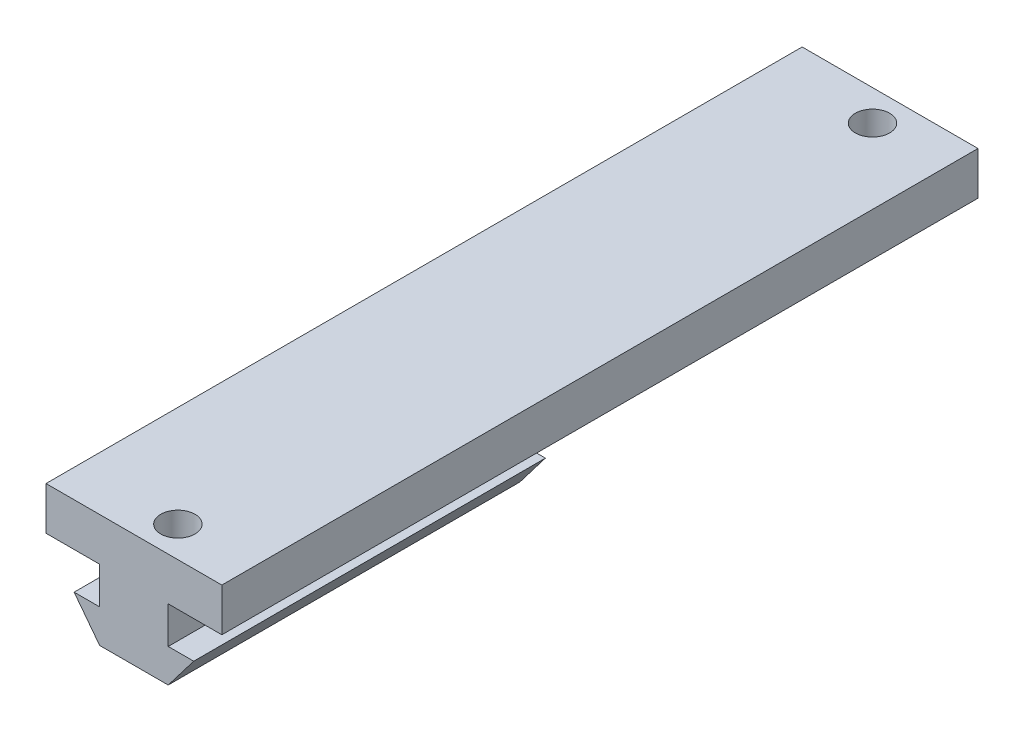
ISO-10303-21;
HEADER;
FILE_DESCRIPTION(('STEP AP214'),'2;1');
FILE_NAME('part.step','',(''),(''),'','','');
FILE_SCHEMA(('AUTOMOTIVE_DESIGN { 1 0 10303 214 1 1 1 1 }'));
ENDSEC;
DATA;
#1=APPLICATION_CONTEXT('core data for automotive mechanical design processes');
#2=APPLICATION_PROTOCOL_DEFINITION('international standard','automotive_design',2000,#1);
#3=PRODUCT_CONTEXT('',#1,'mechanical');
#4=PRODUCT('Part','Part','',(#3));
#5=PRODUCT_RELATED_PRODUCT_CATEGORY('part','',(#4));
#6=PRODUCT_DEFINITION_FORMATION('','',#4);
#7=PRODUCT_DEFINITION_CONTEXT('part definition',#1,'design');
#8=PRODUCT_DEFINITION('design','',#6,#7);
#9=PRODUCT_DEFINITION_SHAPE('','',#8);
#10=(LENGTH_UNIT() NAMED_UNIT(*) SI_UNIT(.MILLI.,.METRE.));
#11=(NAMED_UNIT(*) PLANE_ANGLE_UNIT() SI_UNIT($,.RADIAN.));
#12=(NAMED_UNIT(*) SI_UNIT($,.STERADIAN.) SOLID_ANGLE_UNIT());
#13=UNCERTAINTY_MEASURE_WITH_UNIT(LENGTH_MEASURE(1.E-05),#10,'distance_accuracy_value','');
#14=(GEOMETRIC_REPRESENTATION_CONTEXT(3) GLOBAL_UNCERTAINTY_ASSIGNED_CONTEXT((#13)) GLOBAL_UNIT_ASSIGNED_CONTEXT((#10,
#11,#12)) REPRESENTATION_CONTEXT('',''));
#15=CARTESIAN_POINT('',(0.,0.,0.));
#16=DIRECTION('',(0.,0.,1.));
#17=DIRECTION('',(1.,0.,0.));
#18=AXIS2_PLACEMENT_3D('',#15,#16,#17);
#19=CARTESIAN_POINT('',(10.,4.9,43.));
#20=DIRECTION('',(-1.,0.,0.));
#21=DIRECTION('',(0.,0.,1.));
#22=AXIS2_PLACEMENT_3D('',#19,#20,#21);
#23=PLANE('',#22);
#24=DIRECTION('',(0.,0.,-1.));
#25=VECTOR('',#24,1.);
#26=CARTESIAN_POINT('',(10.,0.,43.));
#27=LINE('',#26,#25);
#28=CARTESIAN_POINT('',(10.,0.,43.));
#29=VERTEX_POINT('',#28);
#30=CARTESIAN_POINT('',(10.,0.,-43.));
#31=VERTEX_POINT('',#30);
#32=EDGE_CURVE('E220',#29,#31,#27,.T.);
#33=ORIENTED_EDGE('',*,*,#32,.T.);
#34=DIRECTION('',(0.,-1.,0.));
#35=VECTOR('',#34,1.);
#36=CARTESIAN_POINT('',(10.,4.9,-43.));
#37=LINE('',#36,#35);
#38=CARTESIAN_POINT('',(10.,4.9,-43.));
#39=VERTEX_POINT('',#38);
#40=EDGE_CURVE('E11',#39,#31,#37,.T.);
#41=ORIENTED_EDGE('',*,*,#40,.F.);
#42=DIRECTION('',(0.,0.,-1.));
#43=VECTOR('',#42,1.);
#44=CARTESIAN_POINT('',(10.,4.9,43.));
#45=LINE('',#44,#43);
#46=CARTESIAN_POINT('',(10.,4.9,43.));
#47=VERTEX_POINT('',#46);
#48=EDGE_CURVE('E238',#47,#39,#45,.T.);
#49=ORIENTED_EDGE('',*,*,#48,.F.);
#50=DIRECTION('',(0.,-1.,0.));
#51=VECTOR('',#50,1.);
#52=CARTESIAN_POINT('',(10.,4.9,43.));
#53=LINE('',#52,#51);
#54=EDGE_CURVE('E249',#47,#29,#53,.T.);
#55=ORIENTED_EDGE('',*,*,#54,.T.);
#56=EDGE_LOOP('',(#33,#41,#49,#55));
#57=FACE_BOUND('',#56,.T.);
#58=ADVANCED_FACE('F44',(#57),#23,.F.);
#59=CARTESIAN_POINT('',(-10.,4.9,-43.));
#60=DIRECTION('',(0.,0.,1.));
#61=DIRECTION('',(1.,0.,0.));
#62=AXIS2_PLACEMENT_3D('',#59,#60,#61);
#63=PLANE('',#62);
#64=DIRECTION('',(-1.,0.,0.));
#65=VECTOR('',#64,1.);
#66=CARTESIAN_POINT('',(-10.,0.,-43.));
#67=LINE('',#66,#65);
#68=CARTESIAN_POINT('',(-10.,0.,-43.));
#69=VERTEX_POINT('',#68);
#70=EDGE_CURVE('E253',#31,#69,#67,.T.);
#71=ORIENTED_EDGE('',*,*,#70,.T.);
#72=DIRECTION('',(0.,-1.,0.));
#73=VECTOR('',#72,1.);
#74=CARTESIAN_POINT('',(-10.,4.9,-43.));
#75=LINE('',#74,#73);
#76=CARTESIAN_POINT('',(-10.,4.9,-43.));
#77=VERTEX_POINT('',#76);
#78=EDGE_CURVE('E53',#77,#69,#75,.T.);
#79=ORIENTED_EDGE('',*,*,#78,.F.);
#80=DIRECTION('',(-1.,0.,0.));
#81=VECTOR('',#80,1.);
#82=CARTESIAN_POINT('',(-10.,4.9,-43.));
#83=LINE('',#82,#81);
#84=EDGE_CURVE('E97',#39,#77,#83,.T.);
#85=ORIENTED_EDGE('',*,*,#84,.F.);
#86=ORIENTED_EDGE('',*,*,#40,.T.);
#87=EDGE_LOOP('',(#71,#79,#85,#86));
#88=FACE_BOUND('',#87,.T.);
#89=ADVANCED_FACE('F295',(#88),#63,.F.);
#90=CARTESIAN_POINT('',(-10.,4.9,43.));
#91=DIRECTION('',(1.,0.,0.));
#92=DIRECTION('',(0.,0.,-1.));
#93=AXIS2_PLACEMENT_3D('',#90,#91,#92);
#94=PLANE('',#93);
#95=DIRECTION('',(0.,0.,1.));
#96=VECTOR('',#95,1.);
#97=CARTESIAN_POINT('',(-10.,0.,43.));
#98=LINE('',#97,#96);
#99=CARTESIAN_POINT('',(-10.,0.,43.));
#100=VERTEX_POINT('',#99);
#101=EDGE_CURVE('E256',#69,#100,#98,.T.);
#102=ORIENTED_EDGE('',*,*,#101,.T.);
#103=DIRECTION('',(0.,-1.,0.));
#104=VECTOR('',#103,1.);
#105=CARTESIAN_POINT('',(-10.,4.9,43.));
#106=LINE('',#105,#104);
#107=CARTESIAN_POINT('',(-10.,4.9,43.));
#108=VERTEX_POINT('',#107);
#109=EDGE_CURVE('E263',#108,#100,#106,.T.);
#110=ORIENTED_EDGE('',*,*,#109,.F.);
#111=DIRECTION('',(0.,0.,1.));
#112=VECTOR('',#111,1.);
#113=CARTESIAN_POINT('',(-10.,4.9,43.));
#114=LINE('',#113,#112);
#115=EDGE_CURVE('E244',#77,#108,#114,.T.);
#116=ORIENTED_EDGE('',*,*,#115,.F.);
#117=ORIENTED_EDGE('',*,*,#78,.T.);
#118=EDGE_LOOP('',(#102,#110,#116,#117));
#119=FACE_BOUND('',#118,.T.);
#120=ADVANCED_FACE('F272',(#119),#94,.F.);
#121=CARTESIAN_POINT('',(-10.,4.9,43.));
#122=DIRECTION('',(0.,0.,-1.));
#123=DIRECTION('',(-1.,0.,0.));
#124=AXIS2_PLACEMENT_3D('',#121,#122,#123);
#125=PLANE('',#124);
#126=DIRECTION('',(1.,0.,0.));
#127=VECTOR('',#126,1.);
#128=CARTESIAN_POINT('',(-10.,0.,43.));
#129=LINE('',#128,#127);
#130=CARTESIAN_POINT('',(-3.90000000000001,0.,43.));
#131=VERTEX_POINT('',#130);
#132=EDGE_CURVE('E241',#100,#131,#129,.T.);
#133=ORIENTED_EDGE('',*,*,#132,.T.);
#134=DIRECTION('',(0.,-1.,0.));
#135=VECTOR('',#134,1.);
#136=CARTESIAN_POINT('',(-3.90000000000001,0.,43.));
#137=LINE('',#136,#135);
#138=CARTESIAN_POINT('',(-3.90000000000001,-4.2,43.));
#139=VERTEX_POINT('',#138);
#140=EDGE_CURVE('E60',#131,#139,#137,.T.);
#141=ORIENTED_EDGE('',*,*,#140,.T.);
#142=DIRECTION('',(-1.,0.,0.));
#143=VECTOR('',#142,1.);
#144=CARTESIAN_POINT('',(-3.90000000000001,-4.2,43.));
#145=LINE('',#144,#143);
#146=CARTESIAN_POINT('',(-6.80000000000001,-4.2,43.));
#147=VERTEX_POINT('',#146);
#148=EDGE_CURVE('E199',#139,#147,#145,.T.);
#149=ORIENTED_EDGE('',*,*,#148,.T.);
#150=DIRECTION('',(0.606673319350191,-0.794951246045077,0.));
#151=VECTOR('',#150,1.);
#152=CARTESIAN_POINT('',(-6.80000000000001,-4.2,43.));
#153=LINE('',#152,#151);
#154=CARTESIAN_POINT('',(-3.90000000000001,-8.,43.));
#155=VERTEX_POINT('',#154);
#156=EDGE_CURVE('E203',#147,#155,#153,.T.);
#157=ORIENTED_EDGE('',*,*,#156,.T.);
#158=DIRECTION('',(1.,0.,0.));
#159=VECTOR('',#158,1.);
#160=CARTESIAN_POINT('',(-3.90000000000001,-8.,43.));
#161=LINE('',#160,#159);
#162=CARTESIAN_POINT('',(3.89999999999999,-8.,43.));
#163=VERTEX_POINT('',#162);
#164=EDGE_CURVE('E207',#155,#163,#161,.T.);
#165=ORIENTED_EDGE('',*,*,#164,.T.);
#166=DIRECTION('',(0.606673319350191,0.794951246045077,0.));
#167=VECTOR('',#166,1.);
#168=CARTESIAN_POINT('',(3.89999999999999,-8.,43.));
#169=LINE('',#168,#167);
#170=CARTESIAN_POINT('',(6.79999999999999,-4.2,43.));
#171=VERTEX_POINT('',#170);
#172=EDGE_CURVE('E211',#163,#171,#169,.T.);
#173=ORIENTED_EDGE('',*,*,#172,.T.);
#174=DIRECTION('',(-1.,0.,0.));
#175=VECTOR('',#174,1.);
#176=CARTESIAN_POINT('',(6.79999999999999,-4.2,43.));
#177=LINE('',#176,#175);
#178=CARTESIAN_POINT('',(3.89999999999999,-4.2,43.));
#179=VERTEX_POINT('',#178);
#180=EDGE_CURVE('E171',#171,#179,#177,.T.);
#181=ORIENTED_EDGE('',*,*,#180,.T.);
#182=DIRECTION('',(0.,1.,0.));
#183=VECTOR('',#182,1.);
#184=CARTESIAN_POINT('',(3.89999999999999,-4.2,43.));
#185=LINE('',#184,#183);
#186=CARTESIAN_POINT('',(3.89999999999998,0.,43.));
#187=VERTEX_POINT('',#186);
#188=EDGE_CURVE('E168',#179,#187,#185,.T.);
#189=ORIENTED_EDGE('',*,*,#188,.T.);
#190=EDGE_CURVE('E90',#187,#29,#129,.T.);
#191=ORIENTED_EDGE('',*,*,#190,.T.);
#192=ORIENTED_EDGE('',*,*,#54,.F.);
#193=DIRECTION('',(1.,0.,0.));
#194=VECTOR('',#193,1.);
#195=CARTESIAN_POINT('',(-10.,4.9,43.));
#196=LINE('',#195,#194);
#197=EDGE_CURVE('E69',#108,#47,#196,.T.);
#198=ORIENTED_EDGE('',*,*,#197,.F.);
#199=ORIENTED_EDGE('',*,*,#109,.T.);
#200=EDGE_LOOP('',(#133,#141,#149,#157,#165,#173,#181,#189,#191,#192,#198,#199));
#201=FACE_BOUND('',#200,.T.);
#202=ADVANCED_FACE('F275',(#201),#125,.F.);
#203=CARTESIAN_POINT('',(0.,4.9,0.));
#204=DIRECTION('',(0.,-1.,0.));
#205=DIRECTION('',(0.,0.,-1.));
#206=AXIS2_PLACEMENT_3D('',#203,#204,#205);
#207=PLANE('',#206);
#208=CARTESIAN_POINT('',(1.49999999999999,4.9,39.5));
#209=DIRECTION('',(0.,1.,0.));
#210=DIRECTION('',(0.,0.,1.));
#211=AXIS2_PLACEMENT_3D('',#208,#209,#210);
#212=CIRCLE('',#211,1.95);
#213=CARTESIAN_POINT('',(1.49999999999999,4.9,41.45));
#214=VERTEX_POINT('',#213);
#215=EDGE_CURVE('E479',#214,#214,#212,.T.);
#216=ORIENTED_EDGE('',*,*,#215,.F.);
#217=EDGE_LOOP('',(#216));
#218=FACE_BOUND('',#217,.T.);
#219=CARTESIAN_POINT('',(1.49999999999998,4.9,-39.5));
#220=DIRECTION('',(0.,1.,0.));
#221=DIRECTION('',(0.,0.,1.));
#222=AXIS2_PLACEMENT_3D('',#219,#220,#221);
#223=CIRCLE('',#222,1.95);
#224=CARTESIAN_POINT('',(1.49999999999998,4.9,-37.55));
#225=VERTEX_POINT('',#224);
#226=EDGE_CURVE('E174',#225,#225,#223,.T.);
#227=ORIENTED_EDGE('',*,*,#226,.F.);
#228=EDGE_LOOP('',(#227));
#229=FACE_BOUND('',#228,.T.);
#230=ORIENTED_EDGE('',*,*,#48,.T.);
#231=ORIENTED_EDGE('',*,*,#84,.T.);
#232=ORIENTED_EDGE('',*,*,#115,.T.);
#233=ORIENTED_EDGE('',*,*,#197,.T.);
#234=EDGE_LOOP('',(#230,#231,#232,#233));
#235=FACE_BOUND('',#234,.T.);
#236=ADVANCED_FACE('F279',(#218,#229,#235),#207,.F.);
#237=CARTESIAN_POINT('',(0.,0.,0.));
#238=DIRECTION('',(0.,-1.,0.));
#239=DIRECTION('',(0.,0.,-1.));
#240=AXIS2_PLACEMENT_3D('',#237,#238,#239);
#241=PLANE('',#240);
#242=CARTESIAN_POINT('',(1.49999999999998,0.,-39.5));
#243=DIRECTION('',(0.,-1.,0.));
#244=DIRECTION('',(0.,0.,-1.));
#245=AXIS2_PLACEMENT_3D('',#242,#243,#244);
#246=CIRCLE('',#245,1.95);
#247=CARTESIAN_POINT('',(1.49999999999998,0.,-41.45));
#248=VERTEX_POINT('',#247);
#249=EDGE_CURVE('E47',#248,#248,#246,.T.);
#250=ORIENTED_EDGE('',*,*,#249,.F.);
#251=EDGE_LOOP('',(#250));
#252=FACE_BOUND('',#251,.T.);
#253=DIRECTION('',(0.,0.,1.));
#254=VECTOR('',#253,1.);
#255=CARTESIAN_POINT('',(3.89999999999998,0.,2.99999999999999));
#256=LINE('',#255,#254);
#257=CARTESIAN_POINT('',(3.89999999999998,0.,2.99999999999999));
#258=VERTEX_POINT('',#257);
#259=EDGE_CURVE('E166',#258,#187,#256,.T.);
#260=ORIENTED_EDGE('',*,*,#259,.F.);
#261=DIRECTION('',(-1.,0.,0.));
#262=VECTOR('',#261,1.);
#263=CARTESIAN_POINT('',(-3.90000000000001,0.,2.99999999999999));
#264=LINE('',#263,#262);
#265=CARTESIAN_POINT('',(-3.90000000000001,0.,2.99999999999999));
#266=VERTEX_POINT('',#265);
#267=EDGE_CURVE('E157',#258,#266,#264,.T.);
#268=ORIENTED_EDGE('',*,*,#267,.T.);
#269=DIRECTION('',(0.,0.,1.));
#270=VECTOR('',#269,1.);
#271=CARTESIAN_POINT('',(-3.90000000000001,0.,2.99999999999999));
#272=LINE('',#271,#270);
#273=EDGE_CURVE('E141',#266,#131,#272,.T.);
#274=ORIENTED_EDGE('',*,*,#273,.T.);
#275=ORIENTED_EDGE('',*,*,#132,.F.);
#276=ORIENTED_EDGE('',*,*,#101,.F.);
#277=ORIENTED_EDGE('',*,*,#70,.F.);
#278=ORIENTED_EDGE('',*,*,#32,.F.);
#279=ORIENTED_EDGE('',*,*,#190,.F.);
#280=EDGE_LOOP('',(#260,#268,#274,#275,#276,#277,#278,#279));
#281=FACE_BOUND('',#280,.T.);
#282=ADVANCED_FACE('F165',(#252,#281),#241,.T.);
#283=CARTESIAN_POINT('',(3.89999999999999,-4.2,2.99999999999999));
#284=DIRECTION('',(1.,0.,0.));
#285=DIRECTION('',(0.,1.,0.));
#286=AXIS2_PLACEMENT_3D('',#283,#284,#285);
#287=PLANE('',#286);
#288=ORIENTED_EDGE('',*,*,#188,.F.);
#289=DIRECTION('',(0.,0.,1.));
#290=VECTOR('',#289,1.);
#291=CARTESIAN_POINT('',(3.89999999999999,-4.2,2.99999999999999));
#292=LINE('',#291,#290);
#293=CARTESIAN_POINT('',(3.89999999999999,-4.2,2.99999999999999));
#294=VERTEX_POINT('',#293);
#295=EDGE_CURVE('E221',#294,#179,#292,.T.);
#296=ORIENTED_EDGE('',*,*,#295,.F.);
#297=DIRECTION('',(0.,1.,0.));
#298=VECTOR('',#297,1.);
#299=CARTESIAN_POINT('',(3.89999999999999,-4.2,2.99999999999999));
#300=LINE('',#299,#298);
#301=EDGE_CURVE('E151',#294,#258,#300,.T.);
#302=ORIENTED_EDGE('',*,*,#301,.T.);
#303=ORIENTED_EDGE('',*,*,#259,.T.);
#304=EDGE_LOOP('',(#288,#296,#302,#303));
#305=FACE_BOUND('',#304,.T.);
#306=ADVANCED_FACE('F287',(#305),#287,.T.);
#307=CARTESIAN_POINT('',(6.79999999999999,-4.2,2.99999999999999));
#308=DIRECTION('',(0.,1.,0.));
#309=DIRECTION('',(0.,0.,1.));
#310=AXIS2_PLACEMENT_3D('',#307,#308,#309);
#311=PLANE('',#310);
#312=ORIENTED_EDGE('',*,*,#180,.F.);
#313=DIRECTION('',(0.,0.,1.));
#314=VECTOR('',#313,1.);
#315=CARTESIAN_POINT('',(6.79999999999999,-4.2,2.99999999999999));
#316=LINE('',#315,#314);
#317=CARTESIAN_POINT('',(6.79999999999999,-4.2,2.99999999999999));
#318=VERTEX_POINT('',#317);
#319=EDGE_CURVE('E224',#318,#171,#316,.T.);
#320=ORIENTED_EDGE('',*,*,#319,.F.);
#321=DIRECTION('',(-1.,0.,0.));
#322=VECTOR('',#321,1.);
#323=CARTESIAN_POINT('',(6.79999999999999,-4.2,2.99999999999999));
#324=LINE('',#323,#322);
#325=EDGE_CURVE('E191',#318,#294,#324,.T.);
#326=ORIENTED_EDGE('',*,*,#325,.T.);
#327=ORIENTED_EDGE('',*,*,#295,.T.);
#328=EDGE_LOOP('',(#312,#320,#326,#327));
#329=FACE_BOUND('',#328,.T.);
#330=ADVANCED_FACE('F321',(#329),#311,.T.);
#331=CARTESIAN_POINT('',(3.89999999999999,-8.,2.99999999999999));
#332=DIRECTION('',(0.794951246045077,-0.606673319350191,0.));
#333=DIRECTION('',(0.606673319350191,0.794951246045077,0.));
#334=AXIS2_PLACEMENT_3D('',#331,#332,#333);
#335=PLANE('',#334);
#336=ORIENTED_EDGE('',*,*,#172,.F.);
#337=DIRECTION('',(0.,0.,1.));
#338=VECTOR('',#337,1.);
#339=CARTESIAN_POINT('',(3.89999999999999,-8.,2.99999999999999));
#340=LINE('',#339,#338);
#341=CARTESIAN_POINT('',(3.89999999999999,-8.,2.99999999999999));
#342=VERTEX_POINT('',#341);
#343=EDGE_CURVE('E227',#342,#163,#340,.T.);
#344=ORIENTED_EDGE('',*,*,#343,.F.);
#345=DIRECTION('',(0.606673319350191,0.794951246045077,0.));
#346=VECTOR('',#345,1.);
#347=CARTESIAN_POINT('',(3.89999999999999,-8.,2.99999999999999));
#348=LINE('',#347,#346);
#349=EDGE_CURVE('E187',#342,#318,#348,.T.);
#350=ORIENTED_EDGE('',*,*,#349,.T.);
#351=ORIENTED_EDGE('',*,*,#319,.T.);
#352=EDGE_LOOP('',(#336,#344,#350,#351));
#353=FACE_BOUND('',#352,.T.);
#354=ADVANCED_FACE('F332',(#353),#335,.T.);
#355=CARTESIAN_POINT('',(-3.90000000000001,-8.,2.99999999999999));
#356=DIRECTION('',(0.,-1.,0.));
#357=DIRECTION('',(1.,0.,0.));
#358=AXIS2_PLACEMENT_3D('',#355,#356,#357);
#359=PLANE('',#358);
#360=ORIENTED_EDGE('',*,*,#164,.F.);
#361=DIRECTION('',(0.,0.,1.));
#362=VECTOR('',#361,1.);
#363=CARTESIAN_POINT('',(-3.90000000000001,-8.,2.99999999999999));
#364=LINE('',#363,#362);
#365=CARTESIAN_POINT('',(-3.90000000000001,-8.,2.99999999999999));
#366=VERTEX_POINT('',#365);
#367=EDGE_CURVE('E230',#366,#155,#364,.T.);
#368=ORIENTED_EDGE('',*,*,#367,.F.);
#369=DIRECTION('',(1.,0.,0.));
#370=VECTOR('',#369,1.);
#371=CARTESIAN_POINT('',(-3.90000000000001,-8.,2.99999999999999));
#372=LINE('',#371,#370);
#373=EDGE_CURVE('E183',#366,#342,#372,.T.);
#374=ORIENTED_EDGE('',*,*,#373,.T.);
#375=ORIENTED_EDGE('',*,*,#343,.T.);
#376=EDGE_LOOP('',(#360,#368,#374,#375));
#377=FACE_BOUND('',#376,.T.);
#378=ADVANCED_FACE('F343',(#377),#359,.T.);
#379=CARTESIAN_POINT('',(-6.80000000000001,-4.2,2.99999999999999));
#380=DIRECTION('',(-0.794951246045077,-0.606673319350191,0.));
#381=DIRECTION('',(0.606673319350191,-0.794951246045077,0.));
#382=AXIS2_PLACEMENT_3D('',#379,#380,#381);
#383=PLANE('',#382);
#384=ORIENTED_EDGE('',*,*,#156,.F.);
#385=DIRECTION('',(0.,0.,1.));
#386=VECTOR('',#385,1.);
#387=CARTESIAN_POINT('',(-6.80000000000001,-4.2,2.99999999999999));
#388=LINE('',#387,#386);
#389=CARTESIAN_POINT('',(-6.80000000000001,-4.2,2.99999999999999));
#390=VERTEX_POINT('',#389);
#391=EDGE_CURVE('E233',#390,#147,#388,.T.);
#392=ORIENTED_EDGE('',*,*,#391,.F.);
#393=DIRECTION('',(0.606673319350191,-0.794951246045077,0.));
#394=VECTOR('',#393,1.);
#395=CARTESIAN_POINT('',(-6.80000000000001,-4.2,2.99999999999999));
#396=LINE('',#395,#394);
#397=EDGE_CURVE('E179',#390,#366,#396,.T.);
#398=ORIENTED_EDGE('',*,*,#397,.T.);
#399=ORIENTED_EDGE('',*,*,#367,.T.);
#400=EDGE_LOOP('',(#384,#392,#398,#399));
#401=FACE_BOUND('',#400,.T.);
#402=ADVANCED_FACE('F354',(#401),#383,.T.);
#403=CARTESIAN_POINT('',(-3.90000000000001,-4.2,2.99999999999999));
#404=DIRECTION('',(0.,1.,0.));
#405=DIRECTION('',(-1.,0.,0.));
#406=AXIS2_PLACEMENT_3D('',#403,#404,#405);
#407=PLANE('',#406);
#408=ORIENTED_EDGE('',*,*,#148,.F.);
#409=DIRECTION('',(0.,0.,1.));
#410=VECTOR('',#409,1.);
#411=CARTESIAN_POINT('',(-3.90000000000001,-4.2,2.99999999999999));
#412=LINE('',#411,#410);
#413=CARTESIAN_POINT('',(-3.90000000000001,-4.2,2.99999999999999));
#414=VERTEX_POINT('',#413);
#415=EDGE_CURVE('E150',#414,#139,#412,.T.);
#416=ORIENTED_EDGE('',*,*,#415,.F.);
#417=DIRECTION('',(-1.,0.,0.));
#418=VECTOR('',#417,1.);
#419=CARTESIAN_POINT('',(-3.90000000000001,-4.2,2.99999999999999));
#420=LINE('',#419,#418);
#421=EDGE_CURVE('E161',#414,#390,#420,.T.);
#422=ORIENTED_EDGE('',*,*,#421,.T.);
#423=ORIENTED_EDGE('',*,*,#391,.T.);
#424=EDGE_LOOP('',(#408,#416,#422,#423));
#425=FACE_BOUND('',#424,.T.);
#426=ADVANCED_FACE('F365',(#425),#407,.T.);
#427=CARTESIAN_POINT('',(-3.90000000000001,0.,2.99999999999999));
#428=DIRECTION('',(-1.,0.,0.));
#429=DIRECTION('',(0.,-1.,0.));
#430=AXIS2_PLACEMENT_3D('',#427,#428,#429);
#431=PLANE('',#430);
#432=ORIENTED_EDGE('',*,*,#140,.F.);
#433=ORIENTED_EDGE('',*,*,#273,.F.);
#434=DIRECTION('',(0.,-1.,0.));
#435=VECTOR('',#434,1.);
#436=CARTESIAN_POINT('',(-3.90000000000001,0.,2.99999999999999));
#437=LINE('',#436,#435);
#438=EDGE_CURVE('E144',#266,#414,#437,.T.);
#439=ORIENTED_EDGE('',*,*,#438,.T.);
#440=ORIENTED_EDGE('',*,*,#415,.T.);
#441=EDGE_LOOP('',(#432,#433,#439,#440));
#442=FACE_BOUND('',#441,.T.);
#443=ADVANCED_FACE('F143',(#442),#431,.T.);
#444=CARTESIAN_POINT('',(0.,0.,2.99999999999999));
#445=DIRECTION('',(0.,0.,1.));
#446=DIRECTION('',(1.,0.,0.));
#447=AXIS2_PLACEMENT_3D('',#444,#445,#446);
#448=PLANE('',#447);
#449=ORIENTED_EDGE('',*,*,#267,.F.);
#450=ORIENTED_EDGE('',*,*,#301,.F.);
#451=ORIENTED_EDGE('',*,*,#325,.F.);
#452=ORIENTED_EDGE('',*,*,#349,.F.);
#453=ORIENTED_EDGE('',*,*,#373,.F.);
#454=ORIENTED_EDGE('',*,*,#397,.F.);
#455=ORIENTED_EDGE('',*,*,#421,.F.);
#456=ORIENTED_EDGE('',*,*,#438,.F.);
#457=EDGE_LOOP('',(#449,#450,#451,#452,#453,#454,#455,#456));
#458=FACE_BOUND('',#457,.T.);
#459=ADVANCED_FACE('F155',(#458),#448,.F.);
#460=CARTESIAN_POINT('',(1.49999999999998,-1.1,-39.5));
#461=DIRECTION('',(0.,1.,0.));
#462=DIRECTION('',(0.,0.,1.));
#463=AXIS2_PLACEMENT_3D('',#460,#461,#462);
#464=CYLINDRICAL_SURFACE('',#463,1.95);
#465=ORIENTED_EDGE('',*,*,#249,.T.);
#466=EDGE_LOOP('',(#465));
#467=FACE_BOUND('',#466,.T.);
#468=ORIENTED_EDGE('',*,*,#226,.T.);
#469=EDGE_LOOP('',(#468));
#470=FACE_BOUND('',#469,.T.);
#471=ADVANCED_FACE('F393',(#467,#470),#464,.F.);
#472=CARTESIAN_POINT('',(1.49999999999999,-1.1,39.5));
#473=DIRECTION('',(0.,1.,0.));
#474=DIRECTION('',(0.,0.,1.));
#475=AXIS2_PLACEMENT_3D('',#472,#473,#474);
#476=CYLINDRICAL_SURFACE('',#475,1.95);
#477=CARTESIAN_POINT('',(1.49999999999999,-1.1,39.5));
#478=DIRECTION('',(0.,1.,0.));
#479=DIRECTION('',(0.,0.,1.));
#480=AXIS2_PLACEMENT_3D('',#477,#478,#479);
#481=CIRCLE('',#480,1.95);
#482=CARTESIAN_POINT('',(1.49999999999999,-1.1,41.45));
#483=VERTEX_POINT('',#482);
#484=EDGE_CURVE('E477',#483,#483,#481,.T.);
#485=ORIENTED_EDGE('',*,*,#484,.F.);
#486=EDGE_LOOP('',(#485));
#487=FACE_BOUND('',#486,.T.);
#488=ORIENTED_EDGE('',*,*,#215,.T.);
#489=EDGE_LOOP('',(#488));
#490=FACE_BOUND('',#489,.T.);
#491=ADVANCED_FACE('F415',(#487,#490),#476,.F.);
#492=CARTESIAN_POINT('',(1.49999999999999,-1.1,39.5));
#493=DIRECTION('',(0.,1.,0.));
#494=DIRECTION('',(0.,0.,1.));
#495=AXIS2_PLACEMENT_3D('',#492,#493,#494);
#496=PLANE('',#495);
#497=ORIENTED_EDGE('',*,*,#484,.T.);
#498=EDGE_LOOP('',(#497));
#499=FACE_BOUND('',#498,.T.);
#500=ADVANCED_FACE('F426',(#499),#496,.T.);
#501=CLOSED_SHELL('',(#58,#89,#120,#202,#236,#282,#306,#330,#354,#378,#402,#426,#443,#459,#471,
#491,#500));
#502=MANIFOLD_SOLID_BREP('B2',#501);
#503=ADVANCED_BREP_SHAPE_REPRESENTATION('',(#18,#502),#14);
#504=SHAPE_DEFINITION_REPRESENTATION(#9,#503);
ENDSEC;
END-ISO-10303-21;
